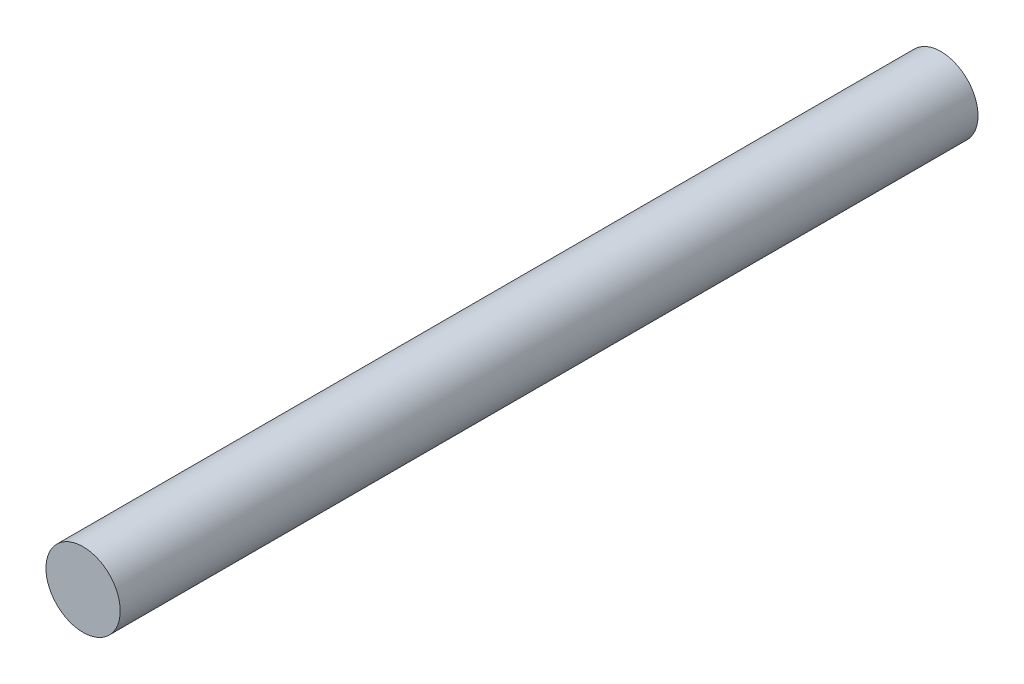
ISO-10303-21;
HEADER;
FILE_DESCRIPTION(('STEP AP214'),'2;1');
FILE_NAME('part.step','',(''),(''),'','','');
FILE_SCHEMA(('AUTOMOTIVE_DESIGN { 1 0 10303 214 1 1 1 1 }'));
ENDSEC;
DATA;
#1=APPLICATION_CONTEXT('core data for automotive mechanical design processes');
#2=APPLICATION_PROTOCOL_DEFINITION('international standard','automotive_design',2000,#1);
#3=PRODUCT_CONTEXT('',#1,'mechanical');
#4=PRODUCT('Part','Part','',(#3));
#5=PRODUCT_RELATED_PRODUCT_CATEGORY('part','',(#4));
#6=PRODUCT_DEFINITION_FORMATION('','',#4);
#7=PRODUCT_DEFINITION_CONTEXT('part definition',#1,'design');
#8=PRODUCT_DEFINITION('design','',#6,#7);
#9=PRODUCT_DEFINITION_SHAPE('','',#8);
#10=(LENGTH_UNIT() NAMED_UNIT(*) SI_UNIT(.MILLI.,.METRE.));
#11=(NAMED_UNIT(*) PLANE_ANGLE_UNIT() SI_UNIT($,.RADIAN.));
#12=(NAMED_UNIT(*) SI_UNIT($,.STERADIAN.) SOLID_ANGLE_UNIT());
#13=UNCERTAINTY_MEASURE_WITH_UNIT(LENGTH_MEASURE(1.E-05),#10,'distance_accuracy_value','');
#14=(GEOMETRIC_REPRESENTATION_CONTEXT(3) GLOBAL_UNCERTAINTY_ASSIGNED_CONTEXT((#13)) GLOBAL_UNIT_ASSIGNED_CONTEXT((#10,
#11,#12)) REPRESENTATION_CONTEXT('',''));
#15=CARTESIAN_POINT('',(0.,0.,0.));
#16=DIRECTION('',(0.,0.,1.));
#17=DIRECTION('',(1.,0.,0.));
#18=AXIS2_PLACEMENT_3D('',#15,#16,#17);
#19=CARTESIAN_POINT('',(0.,0.,63.5));
#20=DIRECTION('',(0.,0.,-1.));
#21=DIRECTION('',(-1.,0.,0.));
#22=AXIS2_PLACEMENT_3D('',#19,#20,#21);
#23=CYLINDRICAL_SURFACE('',#22,5.5);
#24=CARTESIAN_POINT('',(0.,0.,63.5));
#25=DIRECTION('',(0.,0.,1.));
#26=DIRECTION('',(1.,0.,0.));
#27=AXIS2_PLACEMENT_3D('',#24,#25,#26);
#28=CIRCLE('',#27,5.5);
#29=CARTESIAN_POINT('',(5.5,0.,63.5));
#30=VERTEX_POINT('',#29);
#31=EDGE_CURVE('E10',#30,#30,#28,.T.);
#32=ORIENTED_EDGE('',*,*,#31,.F.);
#33=EDGE_LOOP('',(#32));
#34=FACE_BOUND('',#33,.T.);
#35=CARTESIAN_POINT('',(0.,0.,-63.5));
#36=DIRECTION('',(0.,0.,1.));
#37=DIRECTION('',(1.,0.,0.));
#38=AXIS2_PLACEMENT_3D('',#35,#36,#37);
#39=CIRCLE('',#38,5.5);
#40=CARTESIAN_POINT('',(5.5,0.,-63.5));
#41=VERTEX_POINT('',#40);
#42=EDGE_CURVE('E38',#41,#41,#39,.T.);
#43=ORIENTED_EDGE('',*,*,#42,.T.);
#44=EDGE_LOOP('',(#43));
#45=FACE_BOUND('',#44,.T.);
#46=ADVANCED_FACE('F35',(#34,#45),#23,.T.);
#47=CARTESIAN_POINT('',(0.,0.,63.5));
#48=DIRECTION('',(0.,0.,1.));
#49=DIRECTION('',(1.,0.,0.));
#50=AXIS2_PLACEMENT_3D('',#47,#48,#49);
#51=PLANE('',#50);
#52=ORIENTED_EDGE('',*,*,#31,.T.);
#53=EDGE_LOOP('',(#52));
#54=FACE_BOUND('',#53,.T.);
#55=ADVANCED_FACE('F50',(#54),#51,.T.);
#56=CARTESIAN_POINT('',(0.,0.,-63.5));
#57=DIRECTION('',(0.,0.,1.));
#58=DIRECTION('',(1.,0.,0.));
#59=AXIS2_PLACEMENT_3D('',#56,#57,#58);
#60=PLANE('',#59);
#61=ORIENTED_EDGE('',*,*,#42,.F.);
#62=EDGE_LOOP('',(#61));
#63=FACE_BOUND('',#62,.T.);
#64=ADVANCED_FACE('F48',(#63),#60,.F.);
#65=CLOSED_SHELL('',(#46,#55,#64));
#66=MANIFOLD_SOLID_BREP('B2',#65);
#67=ADVANCED_BREP_SHAPE_REPRESENTATION('',(#18,#66),#14);
#68=SHAPE_DEFINITION_REPRESENTATION(#9,#67);
ENDSEC;
END-ISO-10303-21;
